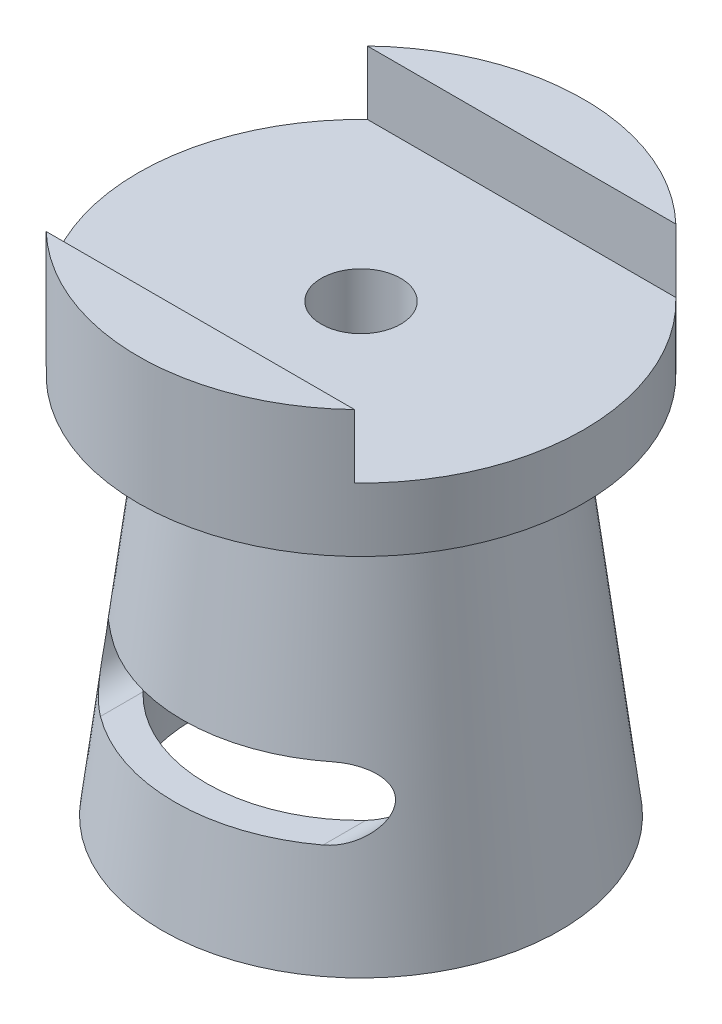
ISO-10303-21;
HEADER;
FILE_DESCRIPTION(('STEP AP214'),'2;1');
FILE_NAME('part.step','',(''),(''),'','','');
FILE_SCHEMA(('AUTOMOTIVE_DESIGN { 1 0 10303 214 1 1 1 1 }'));
ENDSEC;
DATA;
#1=APPLICATION_CONTEXT('core data for automotive mechanical design processes');
#2=APPLICATION_PROTOCOL_DEFINITION('international standard','automotive_design',2000,#1);
#3=PRODUCT_CONTEXT('',#1,'mechanical');
#4=PRODUCT('Part','Part','',(#3));
#5=PRODUCT_RELATED_PRODUCT_CATEGORY('part','',(#4));
#6=PRODUCT_DEFINITION_FORMATION('','',#4);
#7=PRODUCT_DEFINITION_CONTEXT('part definition',#1,'design');
#8=PRODUCT_DEFINITION('design','',#6,#7);
#9=PRODUCT_DEFINITION_SHAPE('','',#8);
#10=(LENGTH_UNIT() NAMED_UNIT(*) SI_UNIT(.MILLI.,.METRE.));
#11=(NAMED_UNIT(*) PLANE_ANGLE_UNIT() SI_UNIT($,.RADIAN.));
#12=(NAMED_UNIT(*) SI_UNIT($,.STERADIAN.) SOLID_ANGLE_UNIT());
#13=UNCERTAINTY_MEASURE_WITH_UNIT(LENGTH_MEASURE(1.E-05),#10,'distance_accuracy_value','');
#14=(GEOMETRIC_REPRESENTATION_CONTEXT(3) GLOBAL_UNCERTAINTY_ASSIGNED_CONTEXT((#13)) GLOBAL_UNIT_ASSIGNED_CONTEXT((#10,
#11,#12)) REPRESENTATION_CONTEXT('',''));
#15=CARTESIAN_POINT('',(0.,0.,0.));
#16=DIRECTION('',(0.,0.,1.));
#17=DIRECTION('',(1.,0.,0.));
#18=AXIS2_PLACEMENT_3D('',#15,#16,#17);
#19=CARTESIAN_POINT('',(0.,-1.,0.));
#20=DIRECTION('',(0.,-1.,0.));
#21=DIRECTION('',(0.,0.,-1.));
#22=AXIS2_PLACEMENT_3D('',#19,#20,#21);
#23=CONICAL_SURFACE('',#22,6.25813999539076,0.1221730476396);
#24=CARTESIAN_POINT('',(0.,11.,0.));
#25=DIRECTION('',(0.,-1.,0.));
#26=DIRECTION('',(0.,0.,-1.));
#27=AXIS2_PLACEMENT_3D('',#24,#25,#26);
#28=CIRCLE('',#27,4.78472526455595);
#29=CARTESIAN_POINT('',(0.,11.,-4.78472526455595));
#30=VERTEX_POINT('',#29);
#31=EDGE_CURVE('E217',#30,#30,#28,.T.);
#32=ORIENTED_EDGE('',*,*,#31,.T.);
#33=EDGE_LOOP('',(#32));
#34=FACE_BOUND('',#33,.T.);
#35=CARTESIAN_POINT('',(0.,-1.,0.));
#36=DIRECTION('',(0.,-1.,0.));
#37=DIRECTION('',(0.,0.,-1.));
#38=AXIS2_PLACEMENT_3D('',#35,#36,#37);
#39=CIRCLE('',#38,6.25813999539076);
#40=CARTESIAN_POINT('',(0.,-1.,-6.25813999539076));
#41=VERTEX_POINT('',#40);
#42=EDGE_CURVE('E220',#41,#41,#39,.T.);
#43=ORIENTED_EDGE('',*,*,#42,.F.);
#44=EDGE_LOOP('',(#43));
#45=FACE_BOUND('',#44,.T.);
#46=CARTESIAN_POINT('',(0.,2.29219561629764,0.));
#47=DIRECTION('',(0.,1.,0.));
#48=DIRECTION('',(0.,0.,1.));
#49=AXIS2_PLACEMENT_3D('',#46,#47,#48);
#50=CIRCLE('',#49,5.8539092022372);
#51=CARTESIAN_POINT('',(3.5,2.29219561629764,4.69236112719784));
#52=VERTEX_POINT('',#51);
#53=CARTESIAN_POINT('',(-3.5,2.29219561629764,4.69236112719784));
#54=VERTEX_POINT('',#53);
#55=EDGE_CURVE('E120',#52,#54,#50,.F.);
#56=ORIENTED_EDGE('',*,*,#55,.T.);
#57=CARTESIAN_POINT('',(-3.4998,2.29219563534526,4.69251029627594));
#58=CARTESIAN_POINT('',(-3.53556817540213,2.29219456626369,4.66583674767626));
#59=CARTESIAN_POINT('',(-3.57086689128526,2.29400901608851,4.63859213751796));
#60=CARTESIAN_POINT('',(-3.64033440999136,2.30102968346209,4.58317434182837));
#61=CARTESIAN_POINT('',(-3.67450417704195,2.30623292362633,4.55500199201743));
#62=CARTESIAN_POINT('',(-3.77493677616918,2.32653416032264,4.46950322645926));
#63=CARTESIAN_POINT('',(-3.83932749388459,2.34632640938452,4.41104170298432));
#64=CARTESIAN_POINT('',(-3.96617563317725,2.39868715880839,4.28871430483889));
#65=CARTESIAN_POINT('',(-4.02821287699285,2.43202434956755,4.224749140768));
#66=CARTESIAN_POINT('',(-4.14470058662806,2.51045011573521,4.09684403035376));
#67=CARTESIAN_POINT('',(-4.19913923939852,2.55555668267937,4.03290427403963));
#68=CARTESIAN_POINT('',(-4.29073529010564,2.64882807682896,3.91810101211576));
#69=CARTESIAN_POINT('',(-4.3292582401038,2.69518520727693,3.86685499908546));
#70=CARTESIAN_POINT('',(-4.39913530770708,2.7964546864292,3.76807498244565));
#71=CARTESIAN_POINT('',(-4.43050606665666,2.85134666515882,3.72053253497834));
#72=CARTESIAN_POINT('',(-4.47449301157326,2.94899818039092,3.64836519401726));
#73=CARTESIAN_POINT('',(-4.48979365421261,2.98900042190405,3.62165601884025));
#74=CARTESIAN_POINT('',(-4.51584405052925,3.07296217034719,3.57252786150123));
#75=CARTESIAN_POINT('',(-4.52660039126712,3.11691583666049,3.550102695607));
#76=CARTESIAN_POINT('',(-4.54079159993427,3.19870878955855,3.51553130628542));
#77=CARTESIAN_POINT('',(-4.54529738826679,3.23585882809898,3.50221322168547));
#78=CARTESIAN_POINT('',(-4.55024823561593,3.31182633781445,3.48044730513531));
#79=CARTESIAN_POINT('',(-4.55069799890587,3.35064182482603,3.47199384174392));
#80=CARTESIAN_POINT('',(-4.54713228623825,3.42918593229431,3.46076238135375));
#81=CARTESIAN_POINT('',(-4.5430863826076,3.46891897095293,3.45802342442323));
#82=CARTESIAN_POINT('',(-4.53048058845422,3.54761683335338,3.4586207733679));
#83=CARTESIAN_POINT('',(-4.52192025801251,3.5865815818434,3.46195767139685));
#84=CARTESIAN_POINT('',(-4.50179554274499,3.65869153335366,3.47360756597478));
#85=CARTESIAN_POINT('',(-4.49061000924763,3.69203195642267,3.48139816450521));
#86=CARTESIAN_POINT('',(-4.46544897947294,3.75644908389589,3.50080812084708));
#87=CARTESIAN_POINT('',(-4.45147220700945,3.78752474392121,3.51242923159907));
#88=CARTESIAN_POINT('',(-4.41296738642072,3.86340545057359,3.54590341770041));
#89=CARTESIAN_POINT('',(-4.38684101655288,3.90645987253708,3.56988080351209));
#90=CARTESIAN_POINT('',(-4.33052020344993,3.98651338099781,3.62270042872433));
#91=CARTESIAN_POINT('',(-4.30031422865743,4.0234946191894,3.65155651888691));
#92=CARTESIAN_POINT('',(-4.22124025214356,4.10844445180495,3.72725196579542));
#93=CARTESIAN_POINT('',(-4.17046861149637,4.15294470290776,3.77598578680316));
#94=CARTESIAN_POINT('',(-4.06379099825674,4.23044718275287,3.87680053124687));
#95=CARTESIAN_POINT('',(-4.00787722817778,4.26343157323338,3.92888650072418));
#96=CARTESIAN_POINT('',(-3.88984789797656,4.31940508596366,4.03629663258574));
#97=CARTESIAN_POINT('',(-3.82757886869991,4.34197589429582,4.09166913363854));
#98=CARTESIAN_POINT('',(-3.69986588691904,4.37509880839307,4.20208045046599));
#99=CARTESIAN_POINT('',(-3.63443016200085,4.38568048189537,4.25711975271825));
#100=CARTESIAN_POINT('',(-3.54539417641525,4.39145837809382,4.32989318008643));
#101=CARTESIAN_POINT('',(-3.52263876733803,4.39219809361059,4.3483113292416));
#102=CARTESIAN_POINT('',(-3.49980000000001,4.39219559725002,4.36661261043372));
#103=B_SPLINE_CURVE_WITH_KNOTS('',3,(#57,#58,#59,#60,#61,#62,#63,#64,#65,#66,#67,#68,#69,#70,
#71,#72,#73,#74,#75,#76,#77,#78,#79,#80,#81,#82,#83,#84,#85,#86,#87,#88,#89,#90,#91,#92,#93,#94,
#95,#96,#97,#98,#99,#100,#101,#102),.UNSPECIFIED.,.F.,.F.,(4,2,2,2,2,2,2,2,2,2,2,2,2,2,2,2,2,2,
2,2,2,2,4),(0.,0.133754715651978,0.267392072918518,0.533908434915628,0.818321655043147,
1.1031722236775,1.33984318841422,1.57595772807553,1.72697650973429,1.87777562914007,
1.99648472877526,2.11505612906989,2.23443496176589,2.35382542976419,2.46145854566226,
2.56914098577563,2.73552581496832,2.90239120048618,3.15084163021917,3.39967522390232,
3.65778231029378,3.91525145503483,4.00306623137901),.UNSPECIFIED.);
#104=CARTESIAN_POINT('',(-3.5,4.39219561629764,4.36645230174603));
#105=VERTEX_POINT('',#104);
#106=EDGE_CURVE('E115',#54,#105,#103,.T.);
#107=ORIENTED_EDGE('',*,*,#106,.T.);
#108=CARTESIAN_POINT('',(0.,4.39219561629764,0.));
#109=DIRECTION('',(0.,-1.,0.));
#110=DIRECTION('',(1.,0.,0.));
#111=AXIS2_PLACEMENT_3D('',#108,#109,#110);
#112=CIRCLE('',#111,5.59606162434111);
#113=CARTESIAN_POINT('',(3.5,4.39219561629764,4.36645230174603));
#114=VERTEX_POINT('',#113);
#115=EDGE_CURVE('E104',#105,#114,#112,.F.);
#116=ORIENTED_EDGE('',*,*,#115,.T.);
#117=CARTESIAN_POINT('',(3.4998,4.39219559725002,4.36661261043372));
#118=CARTESIAN_POINT('',(3.53428995725076,4.39219687798237,4.3389718835288));
#119=CARTESIAN_POINT('',(3.56856115097344,4.39050953074745,4.31109474880423));
#120=CARTESIAN_POINT('',(3.63650474811659,4.38384533265227,4.25501487461661));
#121=CARTESIAN_POINT('',(3.67017724014565,4.37886897280225,4.22681218437251));
#122=CARTESIAN_POINT('',(3.77078447565578,4.35899610205182,4.14131704941305));
#123=CARTESIAN_POINT('',(3.83656238790835,4.33915878834514,4.08373645543616));
#124=CARTESIAN_POINT('',(3.97096466388485,4.28377976787623,3.96302545253223));
#125=CARTESIAN_POINT('',(4.03905961524489,4.24670643328577,3.90001009472391));
#126=CARTESIAN_POINT('',(4.1678558956267,4.15621763377835,3.77858320366517));
#127=CARTESIAN_POINT('',(4.22859386231392,4.10288823076657,3.72014941549445));
#128=CARTESIAN_POINT('',(4.31185916546092,4.00936155054752,3.64054585768352));
#129=CARTESIAN_POINT('',(4.33827291584338,3.97599183337892,3.61538486485426));
#130=CARTESIAN_POINT('',(4.38785176851464,3.90443183377988,3.56898642679504));
#131=CARTESIAN_POINT('',(4.41102156937325,3.86624867887773,3.54774329243681));
#132=CARTESIAN_POINT('',(4.44934343097457,3.79236533812844,3.51418383277141));
#133=CARTESIAN_POINT('',(4.4651881552305,3.75744913185784,3.50094967372952));
#134=CARTESIAN_POINT('',(4.49330778449641,3.68476375717517,3.47938186767627));
#135=CARTESIAN_POINT('',(4.50558625582483,3.64699748683915,3.47104331638226));
#136=CARTESIAN_POINT('',(4.52596271133336,3.56919149130206,3.46018540940773));
#137=CARTESIAN_POINT('',(4.53402758876818,3.52913642655998,3.4577116131712));
#138=CARTESIAN_POINT('',(4.54540127147535,3.44847079367658,3.45912631315042));
#139=CARTESIAN_POINT('',(4.54871081431256,3.40786031266841,3.4630138225109));
#140=CARTESIAN_POINT('',(4.55055314789718,3.3323148290228,3.47589277476744));
#141=CARTESIAN_POINT('',(4.54960227236388,3.29727437060184,3.48422969304464));
#142=CARTESIAN_POINT('',(4.5444089892317,3.22863393614463,3.5048178532362));
#143=CARTESIAN_POINT('',(4.54016498314372,3.19503466802418,3.51707099439015));
#144=CARTESIAN_POINT('',(4.52576673692686,3.11220777714622,3.5521131807573));
#145=CARTESIAN_POINT('',(4.51366609088549,3.06422367030666,3.57703333038661));
#146=CARTESIAN_POINT('',(4.48411408732974,2.97296248172231,3.63184201107644));
#147=CARTESIAN_POINT('',(4.46664738629665,2.92969938614205,3.66174467529164));
#148=CARTESIAN_POINT('',(4.41683864041496,2.82566897968011,3.74170596565954));
#149=CARTESIAN_POINT('',(4.38154929437954,2.76800665902104,3.79395334654487));
#150=CARTESIAN_POINT('',(4.30299938311568,2.66247239303385,3.90213978835316));
#151=CARTESIAN_POINT('',(4.25972481566813,2.61461796205773,3.95808522152613));
#152=CARTESIAN_POINT('',(4.16411660849785,2.52617868014059,4.07415464674446));
#153=CARTESIAN_POINT('',(4.11144910277884,2.48604997626041,4.13435061439278));
#154=CARTESIAN_POINT('',(3.9995516089879,2.41629820519194,4.25445455252976));
#155=CARTESIAN_POINT('',(3.94033466796631,2.38665472823976,4.31436285610723));
#156=CARTESIAN_POINT('',(3.81983570265359,2.34014628221356,4.42884391379495));
#157=CARTESIAN_POINT('',(3.75891803185827,2.3225946619822,4.48351521206132));
#158=CARTESIAN_POINT('',(3.664172452163,2.30460940250259,4.56354826507535));
#159=CARTESIAN_POINT('',(3.63197071981612,2.3000039799305,4.58994069437865));
#160=CARTESIAN_POINT('',(3.56658380011936,2.2937949680405,4.6418943364097));
#161=CARTESIAN_POINT('',(3.53339787954972,2.29219367692464,4.66745489807069));
#162=CARTESIAN_POINT('',(3.49979999999999,2.29219563534525,4.69251029627594));
#163=B_SPLINE_CURVE_WITH_KNOTS('',3,(#117,#118,#119,#120,#121,#122,#123,#124,#125,#126,#127,
#128,#129,#130,#131,#132,#133,#134,#135,#136,#137,#138,#139,#140,#141,#142,#143,#144,#145,#146,
#147,#148,#149,#150,#151,#152,#153,#154,#155,#156,#157,#158,#159,#160,#161,#162),.UNSPECIFIED.,
.F.,.F.,(4,2,2,2,2,2,2,2,2,2,2,2,2,2,2,2,2,2,2,2,2,2,4),(0.,0.132521771057434,0.265023762666833,
0.532870000278452,0.831229937318114,1.12803696929592,1.27598897740485,1.42372442289412,
1.54494923156469,1.66605239248808,1.78809328536761,1.91011524734071,2.01777650467133,
2.12549005360732,2.29076528099358,2.45651756002536,2.71144464858995,2.96682307893618,
3.2343939639413,3.50144111137536,3.75168613085463,3.87724171511567,4.00289331202702),.UNSPECIFIED.);
#164=EDGE_CURVE('E109',#114,#52,#163,.T.);
#165=ORIENTED_EDGE('',*,*,#164,.T.);
#166=EDGE_LOOP('',(#56,#107,#116,#165));
#167=FACE_BOUND('',#166,.T.);
#168=ADVANCED_FACE('F36',(#34,#45,#167),#23,.T.);
#169=CARTESIAN_POINT('',(0.,10.,0.));
#170=DIRECTION('',(0.,-1.,0.));
#171=DIRECTION('',(0.,0.,-1.));
#172=AXIS2_PLACEMENT_3D('',#169,#170,#171);
#173=CONICAL_SURFACE('',#172,3.9,0.1221730476396);
#174=CARTESIAN_POINT('',(0.,-1.,0.));
#175=DIRECTION('',(0.,-1.,0.));
#176=DIRECTION('',(0.,0.,-1.));
#177=AXIS2_PLACEMENT_3D('',#174,#175,#176);
#178=CIRCLE('',#177,5.25063016993191);
#179=CARTESIAN_POINT('',(0.,-1.,-5.25063016993191));
#180=VERTEX_POINT('',#179);
#181=EDGE_CURVE('E222',#180,#180,#178,.T.);
#182=ORIENTED_EDGE('',*,*,#181,.T.);
#183=EDGE_LOOP('',(#182));
#184=FACE_BOUND('',#183,.T.);
#185=CARTESIAN_POINT('',(0.,10.,0.));
#186=DIRECTION('',(0.,-1.,0.));
#187=DIRECTION('',(0.,0.,-1.));
#188=AXIS2_PLACEMENT_3D('',#185,#186,#187);
#189=CIRCLE('',#188,3.9);
#190=CARTESIAN_POINT('',(0.,10.,-3.9));
#191=VERTEX_POINT('',#190);
#192=EDGE_CURVE('E225',#191,#191,#189,.T.);
#193=ORIENTED_EDGE('',*,*,#192,.F.);
#194=EDGE_LOOP('',(#193));
#195=FACE_BOUND('',#194,.T.);
#196=CARTESIAN_POINT('',(0.,4.39219561629764,0.));
#197=DIRECTION('',(0.,-1.,0.));
#198=DIRECTION('',(1.,0.,0.));
#199=AXIS2_PLACEMENT_3D('',#196,#197,#198);
#200=CIRCLE('',#199,4.58855179888226);
#201=CARTESIAN_POINT('',(3.5,4.39219561629764,2.9672896068678));
#202=VERTEX_POINT('',#201);
#203=CARTESIAN_POINT('',(-3.5,4.39219561629764,2.96728960686779));
#204=VERTEX_POINT('',#203);
#205=EDGE_CURVE('E186',#202,#204,#200,.T.);
#206=ORIENTED_EDGE('',*,*,#205,.T.);
#207=CARTESIAN_POINT('',(-3.49980000000001,4.39219559725002,2.96752549988851));
#208=CARTESIAN_POINT('',(-3.54673688803072,4.39218092527216,2.91219175753778));
#209=CARTESIAN_POINT('',(-3.59259696070757,4.38906847215339,2.85601714027076));
#210=CARTESIAN_POINT('',(-3.68185365955562,4.37731143360525,2.74239282550759));
#211=CARTESIAN_POINT('',(-3.72525283713245,4.36867269626128,2.68494453781362));
#212=CARTESIAN_POINT('',(-3.80972647589228,4.34643201420206,2.56858143263364));
#213=CARTESIAN_POINT('',(-3.85077871417803,4.33278956818171,2.50965841103538));
#214=CARTESIAN_POINT('',(-3.93005482928567,4.30103721805053,2.3911084285127));
#215=CARTESIAN_POINT('',(-3.96827814428035,4.28292642960062,2.33148133046994));
#216=CARTESIAN_POINT('',(-4.04382770792138,4.24147757716421,2.20859956645693));
#217=CARTESIAN_POINT('',(-4.08099264937139,4.21790913915098,2.14532367447381));
#218=CARTESIAN_POINT('',(-4.15211905958968,4.16631606317889,2.01872912030908));
#219=CARTESIAN_POINT('',(-4.18607860678284,4.13828877891859,1.95541045510402));
#220=CARTESIAN_POINT('',(-4.25065801419793,4.07769897779591,1.82963090667147));
#221=CARTESIAN_POINT('',(-4.28129095101241,4.04515545608604,1.76716757594381));
#222=CARTESIAN_POINT('',(-4.3393761947609,3.97468998579587,1.64386327382658));
#223=CARTESIAN_POINT('',(-4.36683340628421,3.93677653758969,1.58301991553847));
#224=CARTESIAN_POINT('',(-4.40606972787079,3.87339864546129,1.49369065351979));
#225=CARTESIAN_POINT('',(-4.41902852236876,3.85073794516184,1.46373942120453));
#226=CARTESIAN_POINT('',(-4.44403595159866,3.80266864558547,1.40565158471257));
#227=CARTESIAN_POINT('',(-4.45608471456111,3.77726043468566,1.37751472495869));
#228=CARTESIAN_POINT('',(-4.4757599382952,3.7305692619655,1.33226232806605));
#229=CARTESIAN_POINT('',(-4.48365731413851,3.71021956659126,1.31431330882061));
#230=CARTESIAN_POINT('',(-4.49873313164349,3.66708444837884,1.28121587681683));
#231=CARTESIAN_POINT('',(-4.50591322003898,3.64430486504379,1.26606097836341));
#232=CARTESIAN_POINT('',(-4.51665834084447,3.60515049373531,1.24533918085446));
#233=CARTESIAN_POINT('',(-4.52055720593411,3.58964946397296,1.23832046151174));
#234=CARTESIAN_POINT('',(-4.52779038618743,3.55763716195513,1.22672364659692));
#235=CARTESIAN_POINT('',(-4.53112573705699,3.54112782069199,1.2221410395588));
#236=CARTESIAN_POINT('',(-4.53709454193586,3.50722067163096,1.21597652582214));
#237=CARTESIAN_POINT('',(-4.53972003719207,3.48981520144786,1.21442751807306));
#238=CARTESIAN_POINT('',(-4.5440800950548,3.45491621018222,1.2147101862784));
#239=CARTESIAN_POINT('',(-4.54581451157204,3.43742267513618,1.21654241634914));
#240=CARTESIAN_POINT('',(-4.54822065748316,3.40514861813954,1.22286593896326));
#241=CARTESIAN_POINT('',(-4.54899784929802,3.39030158908957,1.22699757190912));
#242=CARTESIAN_POINT('',(-4.54992697845012,3.36128017595851,1.2371986031728));
#243=CARTESIAN_POINT('',(-4.55007865398147,3.34710607598053,1.2432688117242));
#244=CARTESIAN_POINT('',(-4.54974499590922,3.30750956417255,1.26283264515306));
#245=CARTESIAN_POINT('',(-4.54859093916401,3.28302535883361,1.27819106943673));
#246=CARTESIAN_POINT('',(-4.54491850109949,3.2363863570906,1.31199165720631));
#247=CARTESIAN_POINT('',(-4.54239417041683,3.21424222525092,1.33044702359731));
#248=CARTESIAN_POINT('',(-4.53487012482588,3.16180366188152,1.37833608181721));
#249=CARTESIAN_POINT('',(-4.52926444553153,3.13259066908869,1.40884249685551));
#250=CARTESIAN_POINT('',(-4.51633750799926,3.07691886211541,1.47196603558873));
#251=CARTESIAN_POINT('',(-4.50901239484299,3.05046643241604,1.50458778107199));
#252=CARTESIAN_POINT('',(-4.49286119723976,2.99949424329328,1.57121724755572));
#253=CARTESIAN_POINT('',(-4.48402756015491,2.97498516487901,1.60523125357558));
#254=CARTESIAN_POINT('',(-4.46501821236107,2.92760009397697,1.67402019330179));
#255=CARTESIAN_POINT('',(-4.45484195272288,2.90472477537746,1.70879543336076));
#256=CARTESIAN_POINT('',(-4.42064250166787,2.83446894298296,1.81956100314159));
#257=CARTESIAN_POINT('',(-4.39428890790749,2.78955704551855,1.89641026549564));
#258=CARTESIAN_POINT('',(-4.33592850915201,2.70473013173887,2.05078512977724));
#259=CARTESIAN_POINT('',(-4.30391584088354,2.66482037206595,2.12831135312489));
#260=CARTESIAN_POINT('',(-4.23445303870011,2.5900879885929,2.28274102926598));
#261=CARTESIAN_POINT('',(-4.19703574179786,2.55523702469766,2.35964547542786));
#262=CARTESIAN_POINT('',(-4.11655054989981,2.49071255250872,2.51264527760278));
#263=CARTESIAN_POINT('',(-4.07348488960261,2.46103700739162,2.58874094079561));
#264=CARTESIAN_POINT('',(-3.99100317719958,2.41310996778706,2.724100120336));
#265=CARTESIAN_POINT('',(-3.95264487408603,2.39376345216644,2.78362032031515));
#266=CARTESIAN_POINT('',(-3.87228390734485,2.35943837698156,2.9013999165031));
#267=CARTESIAN_POINT('',(-3.83028386364055,2.34445671056,2.95966018204068));
#268=CARTESIAN_POINT('',(-3.74230933315392,2.31950456373762,3.07497971861434));
#269=CARTESIAN_POINT('',(-3.69630743859314,2.309572450404,3.13202672864224));
#270=CARTESIAN_POINT('',(-3.60069296427862,2.29592708764087,3.244014099826));
#271=CARTESIAN_POINT('',(-3.55107178771766,2.29222918358562,3.29894893840313));
#272=CARTESIAN_POINT('',(-3.49980000000003,2.29219563534517,3.35245982176797));
#273=B_SPLINE_CURVE_WITH_KNOTS('',3,(#207,#208,#209,#210,#211,#212,#213,#214,#215,#216,#217,
#218,#219,#220,#221,#222,#223,#224,#225,#226,#227,#228,#229,#230,#231,#232,#233,#234,#235,#236,
#237,#238,#239,#240,#241,#242,#243,#244,#245,#246,#247,#248,#249,#250,#251,#252,#253,#254,#255,
#256,#257,#258,#259,#260,#261,#262,#263,#264,#265,#266,#267,#268,#269,#270,#271,#272),
.UNSPECIFIED.,.F.,.F.,(4,2,2,2,2,2,2,2,2,2,2,2,2,2,2,2,2,2,2,2,2,2,2,2,2,2,2,2,2,2,2,2,4),(0.,
0.217520717194918,0.434811627147987,0.653901624966003,0.873035018179048,1.10406281473037,
1.33522824010049,1.56544930474368,1.79530992934432,1.91441627882983,2.03350581387321,
2.11814078998855,2.20257676817849,2.25478661048978,2.30689942492767,2.35957433264087,
2.41225787346986,2.45837882487759,2.50451907796089,2.59078711210878,2.67743273024759,
2.80494123748021,2.93273839233468,3.06119521914214,3.1897047290267,3.46779477500002,
3.74617465244941,4.02292925118436,4.29957468414631,4.51958520533959,4.73943874042729,
4.96093867660776,5.18298303840218),.UNSPECIFIED.);
#274=CARTESIAN_POINT('',(-3.5,2.29219561629764,3.35225102270662));
#275=VERTEX_POINT('',#274);
#276=EDGE_CURVE('E11',#204,#275,#273,.T.);
#277=ORIENTED_EDGE('',*,*,#276,.T.);
#278=CARTESIAN_POINT('',(0.,2.29219561629764,0.));
#279=DIRECTION('',(0.,1.,0.));
#280=DIRECTION('',(0.,0.,1.));
#281=AXIS2_PLACEMENT_3D('',#278,#279,#280);
#282=CIRCLE('',#281,4.84639937677835);
#283=CARTESIAN_POINT('',(3.5,2.29219561629764,3.35225102270662));
#284=VERTEX_POINT('',#283);
#285=EDGE_CURVE('E50',#275,#284,#282,.T.);
#286=ORIENTED_EDGE('',*,*,#285,.T.);
#287=CARTESIAN_POINT('',(3.49979999999999,2.29219563534525,3.35245982176798));
#288=CARTESIAN_POINT('',(3.54323286341196,2.29220979616111,3.30712712628153));
#289=CARTESIAN_POINT('',(3.58549574630713,2.29487206842109,3.26075977384547));
#290=CARTESIAN_POINT('',(3.66745578578192,2.30480923476608,3.16642087888085));
#291=CARTESIAN_POINT('',(3.7071574466134,2.3120757736886,3.11845239091849));
#292=CARTESIAN_POINT('',(3.78385407868669,2.3305251422909,3.02130260040327));
#293=CARTESIAN_POINT('',(3.82085408495684,2.3417004497747,2.9721237948326));
#294=CARTESIAN_POINT('',(3.89221282239939,2.36746026782856,2.87271995244686));
#295=CARTESIAN_POINT('',(3.92656993999198,2.38204683948714,2.82249429990384));
#296=CARTESIAN_POINT('',(4.00767930925749,2.42153067321563,2.69817585128351));
#297=CARTESIAN_POINT('',(4.05294381586322,2.44809719285361,2.62363854588367));
#298=CARTESIAN_POINT('',(4.13791504612622,2.50659603844584,2.47350123681878));
#299=CARTESIAN_POINT('',(4.17761953306589,2.5385305125503,2.3979008188597));
#300=CARTESIAN_POINT('',(4.25156173514408,2.60721166888861,2.24621855401777));
#301=CARTESIAN_POINT('',(4.28579915256095,2.6439586129982,2.1701366811506));
#302=CARTESIAN_POINT('',(4.34883888540755,2.7221160885703,2.01817823646049));
#303=CARTESIAN_POINT('',(4.3776449932044,2.76352333351399,1.94230155812316));
#304=CARTESIAN_POINT('',(4.42056265320493,2.83607404350593,1.81825204498472));
#305=CARTESIAN_POINT('',(4.43627540923228,2.86569278328516,1.76973848547565));
#306=CARTESIAN_POINT('',(4.46530145062799,2.92762861371388,1.67362504186658));
#307=CARTESIAN_POINT('',(4.47861165583663,2.95994909154946,1.62602639956556));
#308=CARTESIAN_POINT('',(4.50267774684992,3.02838713108918,1.5322581078807));
#309=CARTESIAN_POINT('',(4.51341268190606,3.06453260240023,1.48610267159207));
#310=CARTESIAN_POINT('',(4.52700455502654,3.1227591968481,1.41994644093003));
#311=CARTESIAN_POINT('',(4.53111362783756,3.1428119904986,1.39842906248687));
#312=CARTESIAN_POINT('',(4.53833189701407,3.18465458111989,1.3569933365978));
#313=CARTESIAN_POINT('',(4.54144264802468,3.20644161074444,1.33707253952056));
#314=CARTESIAN_POINT('',(4.54591286960957,3.24780310232459,1.30344228767132));
#315=CARTESIAN_POINT('',(4.54749570067547,3.26697884066172,1.28927953752329));
#316=CARTESIAN_POINT('',(4.54960297518039,3.30706226055738,1.26355355173124));
#317=CARTESIAN_POINT('',(4.55013011653657,3.32796538473065,1.25198375699087));
#318=CARTESIAN_POINT('',(4.54986258895736,3.36501731679545,1.23569355880385));
#319=CARTESIAN_POINT('',(4.54941658724179,3.38071448837243,1.22995958181103));
#320=CARTESIAN_POINT('',(4.54774762392373,3.41277429117746,1.22102282754786));
#321=CARTESIAN_POINT('',(4.54652587873884,3.42913584308168,1.21781610498594));
#322=CARTESIAN_POINT('',(4.54325152422454,3.46221047917107,1.21434243468262));
#323=CARTESIAN_POINT('',(4.54119345007396,3.47892517644455,1.21409515483404));
#324=CARTESIAN_POINT('',(4.53631202578298,3.51201295153344,1.21661795357094));
#325=CARTESIAN_POINT('',(4.53348803653856,3.52838573169879,1.21939055789768));
#326=CARTESIAN_POINT('',(4.52658663132332,3.56356345145339,1.2283780404276));
#327=CARTESIAN_POINT('',(4.52237115555143,3.58218788715993,1.2351771835161));
#328=CARTESIAN_POINT('',(4.51330110508661,3.61799250305361,1.25156617767595));
#329=CARTESIAN_POINT('',(4.50844496343815,3.63516896725516,1.26116294319585));
#330=CARTESIAN_POINT('',(4.49405885261455,3.68182684639788,1.29102114147321));
#331=CARTESIAN_POINT('',(4.48399647302181,3.70968146956075,1.31352074994402));
#332=CARTESIAN_POINT('',(4.46286855229814,3.76193054294399,1.36179518178825));
#333=CARTESIAN_POINT('',(4.45179944632683,3.7863118451261,1.38758178496584));
#334=CARTESIAN_POINT('',(4.42199301370705,3.84631135817466,1.45688001034101));
#335=CARTESIAN_POINT('',(4.40261643915801,3.87996907986362,1.50179807718381));
#336=CARTESIAN_POINT('',(4.3619349382096,3.94299950536162,1.59376000474717));
#337=CARTESIAN_POINT('',(4.34062594394327,3.97236281323707,1.64080824031362));
#338=CARTESIAN_POINT('',(4.2960139502878,4.02785890772562,1.73619742019528));
#339=CARTESIAN_POINT('',(4.2727020130654,4.05397579042942,1.78454341834313));
#340=CARTESIAN_POINT('',(4.22418817951305,4.10327652307055,1.88170064682719));
#341=CARTESIAN_POINT('',(4.19898794178228,4.12646290002728,1.93051143676011));
#342=CARTESIAN_POINT('',(4.13457100777899,4.18023241146372,2.05090277038602));
#343=CARTESIAN_POINT('',(4.09425656119249,4.2092853473167,2.12258694586969));
#344=CARTESIAN_POINT('',(4.00946524946888,4.26166631241342,2.26566737538368));
#345=CARTESIAN_POINT('',(3.96498514484173,4.28498983415886,2.3370633595313));
#346=CARTESIAN_POINT('',(3.87222327112373,4.32529915198763,2.47855820374703));
#347=CARTESIAN_POINT('',(3.82396510056102,4.34232099612651,2.54866219107143));
#348=CARTESIAN_POINT('',(3.72365283892916,4.36941199402616,2.68741621595567));
#349=CARTESIAN_POINT('',(3.67160325150089,4.37948925268412,2.75606785746792));
#350=CARTESIAN_POINT('',(3.59861150175034,4.38773413678414,2.84794520868943));
#351=CARTESIAN_POINT('',(3.57913748785813,4.38939466140043,2.8720551947159));
#352=CARTESIAN_POINT('',(3.53977271073179,4.39162728890782,2.92000326998445));
#353=CARTESIAN_POINT('',(3.5198817449392,4.39219884977296,2.94384121795652));
#354=CARTESIAN_POINT('',(3.49980000000001,4.39219559725003,2.96752549988852));
#355=B_SPLINE_CURVE_WITH_KNOTS('',3,(#287,#288,#289,#290,#291,#292,#293,#294,#295,#296,#297,
#298,#299,#300,#301,#302,#303,#304,#305,#306,#307,#308,#309,#310,#311,#312,#313,#314,#315,#316,
#317,#318,#319,#320,#321,#322,#323,#324,#325,#326,#327,#328,#329,#330,#331,#332,#333,#334,#335,
#336,#337,#338,#339,#340,#341,#342,#343,#344,#345,#346,#347,#348,#349,#350,#351,#352,#353,#354),
.UNSPECIFIED.,.F.,.F.,(4,2,2,2,2,2,2,2,2,2,2,2,2,2,2,2,2,2,2,2,2,2,2,2,2,2,2,2,2,2,2,2,2,4),(0.,
0.188178824857728,0.376017143949234,0.563495950249264,0.751088325388407,1.02418164668855,
1.29738451590615,1.57060225793418,1.84362851566308,2.02044766398819,2.19749191545498,
2.3759310336606,2.46495589783299,2.5538414468863,2.62536997393927,2.69671546845764,
2.74668804085485,2.79658244578856,2.84680825672378,2.89707610731206,2.9575426806082,
3.01815998545909,3.12911595080365,3.24048136571861,3.41820218436793,3.5963062085217,
3.77525096904302,3.95404035444683,4.21541141039461,4.4769874407661,4.73704314609394,
4.99679482886485,5.08988669772203,5.18302489047173),.UNSPECIFIED.);
#356=EDGE_CURVE('E179',#284,#202,#355,.T.);
#357=ORIENTED_EDGE('',*,*,#356,.T.);
#358=EDGE_LOOP('',(#206,#277,#286,#357));
#359=FACE_BOUND('',#358,.T.);
#360=ADVANCED_FACE('F173',(#184,#195,#359),#173,.F.);
#361=CARTESIAN_POINT('',(0.,15.,0.));
#362=DIRECTION('',(0.,1.,0.));
#363=DIRECTION('',(0.,0.,1.));
#364=AXIS2_PLACEMENT_3D('',#361,#362,#363);
#365=PLANE('',#364);
#366=DIRECTION('',(-1.,0.,0.));
#367=VECTOR('',#366,1.);
#368=CARTESIAN_POINT('',(-4.84742199524655,15.,-5.05));
#369=LINE('',#368,#367);
#370=CARTESIAN_POINT('',(4.84742199524655,15.,-5.05));
#371=VERTEX_POINT('',#370);
#372=CARTESIAN_POINT('',(-4.84742199524655,15.,-5.05));
#373=VERTEX_POINT('',#372);
#374=EDGE_CURVE('E253',#371,#373,#369,.T.);
#375=ORIENTED_EDGE('',*,*,#374,.F.);
#376=CARTESIAN_POINT('',(0.,15.,0.));
#377=DIRECTION('',(0.,1.,0.));
#378=DIRECTION('',(0.,0.,1.));
#379=AXIS2_PLACEMENT_3D('',#376,#377,#378);
#380=CIRCLE('',#379,7.);
#381=EDGE_CURVE('E228',#371,#373,#380,.T.);
#382=ORIENTED_EDGE('',*,*,#381,.T.);
#383=EDGE_LOOP('',(#375,#382));
#384=FACE_BOUND('',#383,.T.);
#385=ADVANCED_FACE('F162',(#384),#365,.T.);
#386=CARTESIAN_POINT('',(6.25813999539076,-1.,0.));
#387=DIRECTION('',(0.,-1.,0.));
#388=DIRECTION('',(0.,0.,-1.));
#389=AXIS2_PLACEMENT_3D('',#386,#387,#388);
#390=PLANE('',#389);
#391=ORIENTED_EDGE('',*,*,#42,.T.);
#392=EDGE_LOOP('',(#391));
#393=FACE_BOUND('',#392,.T.);
#394=ORIENTED_EDGE('',*,*,#181,.F.);
#395=EDGE_LOOP('',(#394));
#396=FACE_BOUND('',#395,.T.);
#397=ADVANCED_FACE('F171',(#393,#396),#390,.T.);
#398=CARTESIAN_POINT('',(0.,10.,0.));
#399=DIRECTION('',(0.,-1.,0.));
#400=DIRECTION('',(0.,0.,-1.));
#401=AXIS2_PLACEMENT_3D('',#398,#399,#400);
#402=PLANE('',#401);
#403=CARTESIAN_POINT('',(0.,10.,0.));
#404=DIRECTION('',(0.,1.,0.));
#405=DIRECTION('',(0.,0.,1.));
#406=AXIS2_PLACEMENT_3D('',#403,#404,#405);
#407=CIRCLE('',#406,1.25);
#408=CARTESIAN_POINT('',(0.,10.,1.25));
#409=VERTEX_POINT('',#408);
#410=EDGE_CURVE('E124',#409,#409,#407,.T.);
#411=ORIENTED_EDGE('',*,*,#410,.T.);
#412=EDGE_LOOP('',(#411));
#413=FACE_BOUND('',#412,.T.);
#414=ORIENTED_EDGE('',*,*,#192,.T.);
#415=EDGE_LOOP('',(#414));
#416=FACE_BOUND('',#415,.T.);
#417=ADVANCED_FACE('F168',(#413,#416),#402,.T.);
#418=CARTESIAN_POINT('',(0.,15.,0.));
#419=DIRECTION('',(0.,-1.,0.));
#420=DIRECTION('',(0.,0.,-1.));
#421=AXIS2_PLACEMENT_3D('',#418,#419,#420);
#422=CYLINDRICAL_SURFACE('',#421,7.);
#423=ORIENTED_EDGE('',*,*,#381,.F.);
#424=DIRECTION('',(0.,1.,0.));
#425=VECTOR('',#424,1.);
#426=CARTESIAN_POINT('',(4.84742199524655,13.,-5.05));
#427=LINE('',#426,#425);
#428=CARTESIAN_POINT('',(4.84742199524655,13.,-5.05));
#429=VERTEX_POINT('',#428);
#430=EDGE_CURVE('E247',#429,#371,#427,.T.);
#431=ORIENTED_EDGE('',*,*,#430,.F.);
#432=CARTESIAN_POINT('',(0.,13.,0.));
#433=DIRECTION('',(0.,1.,0.));
#434=DIRECTION('',(0.,0.,1.));
#435=AXIS2_PLACEMENT_3D('',#432,#433,#434);
#436=CIRCLE('',#435,7.);
#437=CARTESIAN_POINT('',(4.84742199524655,13.,5.05));
#438=VERTEX_POINT('',#437);
#439=EDGE_CURVE('E262',#438,#429,#436,.T.);
#440=ORIENTED_EDGE('',*,*,#439,.F.);
#441=DIRECTION('',(0.,1.,0.));
#442=VECTOR('',#441,1.);
#443=CARTESIAN_POINT('',(4.84742199524655,13.,5.05));
#444=LINE('',#443,#442);
#445=CARTESIAN_POINT('',(4.84742199524655,15.,5.05));
#446=VERTEX_POINT('',#445);
#447=EDGE_CURVE('E250',#438,#446,#444,.T.);
#448=ORIENTED_EDGE('',*,*,#447,.T.);
#449=CARTESIAN_POINT('',(-4.84742199524655,15.,5.05));
#450=VERTEX_POINT('',#449);
#451=EDGE_CURVE('E231',#450,#446,#380,.T.);
#452=ORIENTED_EDGE('',*,*,#451,.F.);
#453=DIRECTION('',(0.,1.,0.));
#454=VECTOR('',#453,1.);
#455=CARTESIAN_POINT('',(-4.84742199524655,13.,5.05));
#456=LINE('',#455,#454);
#457=CARTESIAN_POINT('',(-4.84742199524655,13.,5.05));
#458=VERTEX_POINT('',#457);
#459=EDGE_CURVE('E240',#458,#450,#456,.T.);
#460=ORIENTED_EDGE('',*,*,#459,.F.);
#461=CARTESIAN_POINT('',(0.,13.,0.));
#462=DIRECTION('',(0.,1.,0.));
#463=DIRECTION('',(0.,0.,1.));
#464=AXIS2_PLACEMENT_3D('',#461,#462,#463);
#465=CIRCLE('',#464,7.);
#466=CARTESIAN_POINT('',(-4.84742199524655,13.,-5.05));
#467=VERTEX_POINT('',#466);
#468=EDGE_CURVE('E271',#467,#458,#465,.T.);
#469=ORIENTED_EDGE('',*,*,#468,.F.);
#470=DIRECTION('',(0.,1.,0.));
#471=VECTOR('',#470,1.);
#472=CARTESIAN_POINT('',(-4.84742199524655,13.,-5.05));
#473=LINE('',#472,#471);
#474=EDGE_CURVE('E243',#467,#373,#473,.T.);
#475=ORIENTED_EDGE('',*,*,#474,.T.);
#476=EDGE_LOOP('',(#423,#431,#440,#448,#452,#460,#469,#475));
#477=FACE_BOUND('',#476,.T.);
#478=CARTESIAN_POINT('',(0.,11.,0.));
#479=DIRECTION('',(0.,1.,0.));
#480=DIRECTION('',(0.,0.,1.));
#481=AXIS2_PLACEMENT_3D('',#478,#479,#480);
#482=CIRCLE('',#481,7.);
#483=CARTESIAN_POINT('',(0.,11.,7.));
#484=VERTEX_POINT('',#483);
#485=EDGE_CURVE('E237',#484,#484,#482,.T.);
#486=ORIENTED_EDGE('',*,*,#485,.T.);
#487=EDGE_LOOP('',(#486));
#488=FACE_BOUND('',#487,.T.);
#489=ADVANCED_FACE('F160',(#477,#488),#422,.T.);
#490=DIRECTION('',(1.,0.,0.));
#491=VECTOR('',#490,1.);
#492=CARTESIAN_POINT('',(-4.84742199524655,15.,5.05));
#493=LINE('',#492,#491);
#494=EDGE_CURVE('E270',#450,#446,#493,.T.);
#495=ORIENTED_EDGE('',*,*,#494,.F.);
#496=ORIENTED_EDGE('',*,*,#451,.T.);
#497=EDGE_LOOP('',(#495,#496));
#498=FACE_BOUND('',#497,.T.);
#499=ADVANCED_FACE('F157',(#498),#365,.T.);
#500=CARTESIAN_POINT('',(0.,11.,0.));
#501=DIRECTION('',(0.,1.,0.));
#502=DIRECTION('',(0.,0.,1.));
#503=AXIS2_PLACEMENT_3D('',#500,#501,#502);
#504=PLANE('',#503);
#505=ORIENTED_EDGE('',*,*,#31,.F.);
#506=EDGE_LOOP('',(#505));
#507=FACE_BOUND('',#506,.T.);
#508=ORIENTED_EDGE('',*,*,#485,.F.);
#509=EDGE_LOOP('',(#508));
#510=FACE_BOUND('',#509,.T.);
#511=ADVANCED_FACE('F152',(#507,#510),#504,.F.);
#512=CARTESIAN_POINT('',(-4.84742199524655,13.,-5.05));
#513=DIRECTION('',(0.,0.,-1.));
#514=DIRECTION('',(-1.,0.,0.));
#515=AXIS2_PLACEMENT_3D('',#512,#513,#514);
#516=PLANE('',#515);
#517=ORIENTED_EDGE('',*,*,#374,.T.);
#518=ORIENTED_EDGE('',*,*,#474,.F.);
#519=DIRECTION('',(-1.,0.,0.));
#520=VECTOR('',#519,1.);
#521=CARTESIAN_POINT('',(-4.84742199524655,13.,-5.05));
#522=LINE('',#521,#520);
#523=EDGE_CURVE('E258',#429,#467,#522,.T.);
#524=ORIENTED_EDGE('',*,*,#523,.F.);
#525=ORIENTED_EDGE('',*,*,#430,.T.);
#526=EDGE_LOOP('',(#517,#518,#524,#525));
#527=FACE_BOUND('',#526,.T.);
#528=ADVANCED_FACE('F149',(#527),#516,.F.);
#529=CARTESIAN_POINT('',(-4.84742199524655,13.,5.05));
#530=DIRECTION('',(0.,0.,1.));
#531=DIRECTION('',(1.,0.,0.));
#532=AXIS2_PLACEMENT_3D('',#529,#530,#531);
#533=PLANE('',#532);
#534=ORIENTED_EDGE('',*,*,#494,.T.);
#535=ORIENTED_EDGE('',*,*,#447,.F.);
#536=DIRECTION('',(1.,0.,0.));
#537=VECTOR('',#536,1.);
#538=CARTESIAN_POINT('',(-4.84742199524655,13.,5.05));
#539=LINE('',#538,#537);
#540=EDGE_CURVE('E267',#458,#438,#539,.T.);
#541=ORIENTED_EDGE('',*,*,#540,.F.);
#542=ORIENTED_EDGE('',*,*,#459,.T.);
#543=EDGE_LOOP('',(#534,#535,#541,#542));
#544=FACE_BOUND('',#543,.T.);
#545=ADVANCED_FACE('F147',(#544),#533,.F.);
#546=CARTESIAN_POINT('',(0.,13.,0.));
#547=DIRECTION('',(0.,1.,0.));
#548=DIRECTION('',(0.,0.,1.));
#549=AXIS2_PLACEMENT_3D('',#546,#547,#548);
#550=PLANE('',#549);
#551=CARTESIAN_POINT('',(0.,13.,0.));
#552=DIRECTION('',(0.,1.,0.));
#553=DIRECTION('',(0.,0.,1.));
#554=AXIS2_PLACEMENT_3D('',#551,#552,#553);
#555=CIRCLE('',#554,1.25);
#556=CARTESIAN_POINT('',(0.,13.,1.25));
#557=VERTEX_POINT('',#556);
#558=EDGE_CURVE('E121',#557,#557,#555,.T.);
#559=ORIENTED_EDGE('',*,*,#558,.F.);
#560=EDGE_LOOP('',(#559));
#561=FACE_BOUND('',#560,.T.);
#562=ORIENTED_EDGE('',*,*,#468,.T.);
#563=ORIENTED_EDGE('',*,*,#540,.T.);
#564=ORIENTED_EDGE('',*,*,#439,.T.);
#565=ORIENTED_EDGE('',*,*,#523,.T.);
#566=EDGE_LOOP('',(#562,#563,#564,#565));
#567=FACE_BOUND('',#566,.T.);
#568=ADVANCED_FACE('F143',(#561,#567),#550,.T.);
#569=CARTESIAN_POINT('',(0.,10.,0.));
#570=DIRECTION('',(0.,1.,0.));
#571=DIRECTION('',(0.,0.,1.));
#572=AXIS2_PLACEMENT_3D('',#569,#570,#571);
#573=CYLINDRICAL_SURFACE('',#572,1.25);
#574=ORIENTED_EDGE('',*,*,#410,.F.);
#575=EDGE_LOOP('',(#574));
#576=FACE_BOUND('',#575,.T.);
#577=ORIENTED_EDGE('',*,*,#558,.T.);
#578=EDGE_LOOP('',(#577));
#579=FACE_BOUND('',#578,.T.);
#580=ADVANCED_FACE('F138',(#576,#579),#573,.F.);
#581=CARTESIAN_POINT('',(-3.5,3.34219561629764,10.));
#582=DIRECTION('',(0.,0.,-1.));
#583=DIRECTION('',(-1.,0.,0.));
#584=AXIS2_PLACEMENT_3D('',#581,#582,#583);
#585=CYLINDRICAL_SURFACE('',#584,1.05);
#586=DIRECTION('',(0.,0.,-1.));
#587=VECTOR('',#586,1.);
#588=CARTESIAN_POINT('',(-3.5,2.29219561629764,10.));
#589=LINE('',#588,#587);
#590=EDGE_CURVE('E110',#54,#275,#589,.T.);
#591=ORIENTED_EDGE('',*,*,#590,.T.);
#592=ORIENTED_EDGE('',*,*,#276,.F.);
#593=DIRECTION('',(0.,0.,-1.));
#594=VECTOR('',#593,1.);
#595=CARTESIAN_POINT('',(-3.5,4.39219561629764,10.));
#596=LINE('',#595,#594);
#597=EDGE_CURVE('E62',#105,#204,#596,.T.);
#598=ORIENTED_EDGE('',*,*,#597,.F.);
#599=ORIENTED_EDGE('',*,*,#106,.F.);
#600=EDGE_LOOP('',(#591,#592,#598,#599));
#601=FACE_BOUND('',#600,.T.);
#602=ADVANCED_FACE('F114',(#601),#585,.F.);
#603=CARTESIAN_POINT('',(-3.5,2.29219561629764,10.));
#604=DIRECTION('',(0.,1.,0.));
#605=DIRECTION('',(0.,0.,1.));
#606=AXIS2_PLACEMENT_3D('',#603,#604,#605);
#607=PLANE('',#606);
#608=DIRECTION('',(0.,0.,-1.));
#609=VECTOR('',#608,1.);
#610=CARTESIAN_POINT('',(3.5,2.29219561629764,10.));
#611=LINE('',#610,#609);
#612=EDGE_CURVE('E200',#52,#284,#611,.T.);
#613=ORIENTED_EDGE('',*,*,#612,.T.);
#614=ORIENTED_EDGE('',*,*,#285,.F.);
#615=ORIENTED_EDGE('',*,*,#590,.F.);
#616=ORIENTED_EDGE('',*,*,#55,.F.);
#617=EDGE_LOOP('',(#613,#614,#615,#616));
#618=FACE_BOUND('',#617,.T.);
#619=ADVANCED_FACE('F137',(#618),#607,.T.);
#620=CARTESIAN_POINT('',(3.5,3.34219561629764,10.));
#621=DIRECTION('',(0.,0.,-1.));
#622=DIRECTION('',(-1.,0.,0.));
#623=AXIS2_PLACEMENT_3D('',#620,#621,#622);
#624=CYLINDRICAL_SURFACE('',#623,1.05);
#625=DIRECTION('',(0.,0.,-1.));
#626=VECTOR('',#625,1.);
#627=CARTESIAN_POINT('',(3.5,4.39219561629764,10.));
#628=LINE('',#627,#626);
#629=EDGE_CURVE('E57',#114,#202,#628,.T.);
#630=ORIENTED_EDGE('',*,*,#629,.T.);
#631=ORIENTED_EDGE('',*,*,#356,.F.);
#632=ORIENTED_EDGE('',*,*,#612,.F.);
#633=ORIENTED_EDGE('',*,*,#164,.F.);
#634=EDGE_LOOP('',(#630,#631,#632,#633));
#635=FACE_BOUND('',#634,.T.);
#636=ADVANCED_FACE('F188',(#635),#624,.F.);
#637=CARTESIAN_POINT('',(-3.5,4.39219561629764,10.));
#638=DIRECTION('',(0.,-1.,0.));
#639=DIRECTION('',(1.,0.,0.));
#640=AXIS2_PLACEMENT_3D('',#637,#638,#639);
#641=PLANE('',#640);
#642=ORIENTED_EDGE('',*,*,#597,.T.);
#643=ORIENTED_EDGE('',*,*,#205,.F.);
#644=ORIENTED_EDGE('',*,*,#629,.F.);
#645=ORIENTED_EDGE('',*,*,#115,.F.);
#646=EDGE_LOOP('',(#642,#643,#644,#645));
#647=FACE_BOUND('',#646,.T.);
#648=ADVANCED_FACE('F105',(#647),#641,.T.);
#649=CLOSED_SHELL('',(#168,#360,#385,#397,#417,#489,#499,#511,#528,#545,#568,#580,#602,#619,
#636,#648));
#650=MANIFOLD_SOLID_BREP('B2',#649);
#651=ADVANCED_BREP_SHAPE_REPRESENTATION('',(#18,#650),#14);
#652=SHAPE_DEFINITION_REPRESENTATION(#9,#651);
ENDSEC;
END-ISO-10303-21;
